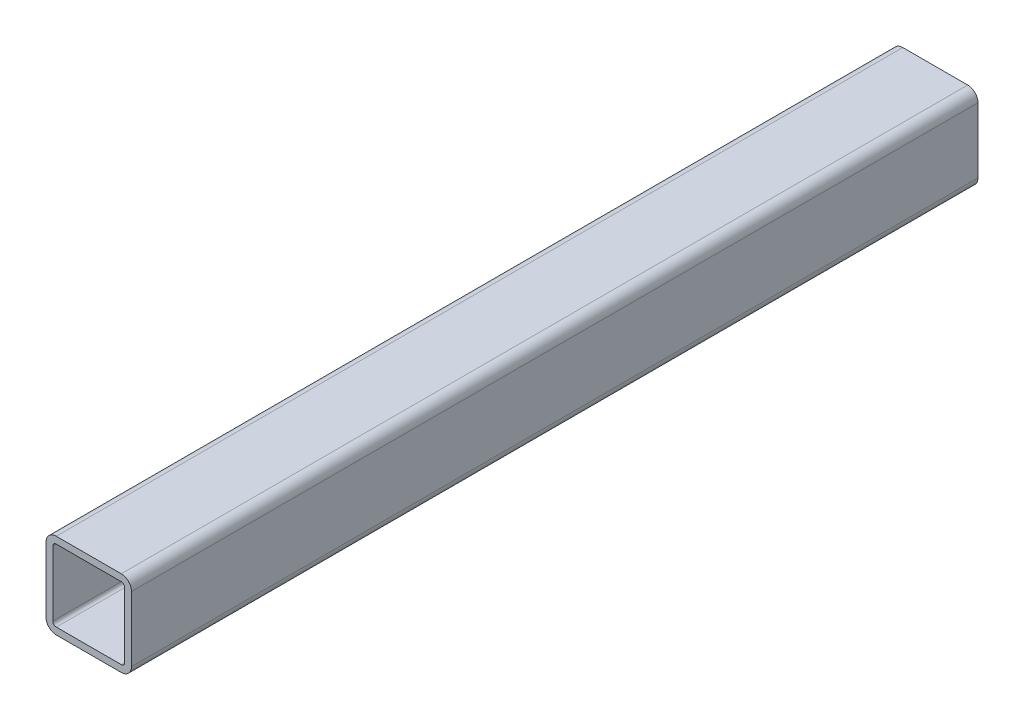
ISO-10303-21;
HEADER;
FILE_DESCRIPTION(('STEP AP214'),'2;1');
FILE_NAME('part.step','',(''),(''),'','','');
FILE_SCHEMA(('AUTOMOTIVE_DESIGN { 1 0 10303 214 1 1 1 1 }'));
ENDSEC;
DATA;
#1=APPLICATION_CONTEXT('core data for automotive mechanical design processes');
#2=APPLICATION_PROTOCOL_DEFINITION('international standard','automotive_design',2000,#1);
#3=PRODUCT_CONTEXT('',#1,'mechanical');
#4=PRODUCT('Part','Part','',(#3));
#5=PRODUCT_RELATED_PRODUCT_CATEGORY('part','',(#4));
#6=PRODUCT_DEFINITION_FORMATION('','',#4);
#7=PRODUCT_DEFINITION_CONTEXT('part definition',#1,'design');
#8=PRODUCT_DEFINITION('design','',#6,#7);
#9=PRODUCT_DEFINITION_SHAPE('','',#8);
#10=(LENGTH_UNIT() NAMED_UNIT(*) SI_UNIT(.MILLI.,.METRE.));
#11=(NAMED_UNIT(*) PLANE_ANGLE_UNIT() SI_UNIT($,.RADIAN.));
#12=(NAMED_UNIT(*) SI_UNIT($,.STERADIAN.) SOLID_ANGLE_UNIT());
#13=UNCERTAINTY_MEASURE_WITH_UNIT(LENGTH_MEASURE(1.E-05),#10,'distance_accuracy_value','');
#14=(GEOMETRIC_REPRESENTATION_CONTEXT(3) GLOBAL_UNCERTAINTY_ASSIGNED_CONTEXT((#13)) GLOBAL_UNIT_ASSIGNED_CONTEXT((#10,
#11,#12)) REPRESENTATION_CONTEXT('',''));
#15=CARTESIAN_POINT('',(0.,0.,0.));
#16=DIRECTION('',(0.,0.,1.));
#17=DIRECTION('',(1.,0.,0.));
#18=AXIS2_PLACEMENT_3D('',#15,#16,#17);
#19=CARTESIAN_POINT('',(0.,0.,247.5));
#20=DIRECTION('',(0.,0.,1.));
#21=DIRECTION('',(1.,0.,0.));
#22=AXIS2_PLACEMENT_3D('',#19,#20,#21);
#23=PLANE('',#22);
#24=DIRECTION('',(0.,1.,0.));
#25=VECTOR('',#24,1.);
#26=CARTESIAN_POINT('',(-12.5,-4.75,247.5));
#27=LINE('',#26,#25);
#28=CARTESIAN_POINT('',(-12.5,-9.5,247.5));
#29=VERTEX_POINT('',#28);
#30=CARTESIAN_POINT('',(-12.5,9.5,247.5));
#31=VERTEX_POINT('',#30);
#32=EDGE_CURVE('E210',#29,#31,#27,.T.);
#33=ORIENTED_EDGE('',*,*,#32,.F.);
#34=CARTESIAN_POINT('',(-9.5,-9.5,247.5));
#35=DIRECTION('',(0.,0.,-1.));
#36=DIRECTION('',(1.,0.,0.));
#37=AXIS2_PLACEMENT_3D('',#34,#35,#36);
#38=CIRCLE('',#37,3.);
#39=CARTESIAN_POINT('',(-9.5,-12.5,247.5));
#40=VERTEX_POINT('',#39);
#41=EDGE_CURVE('E237',#40,#29,#38,.T.);
#42=ORIENTED_EDGE('',*,*,#41,.F.);
#43=DIRECTION('',(-1.,0.,0.));
#44=VECTOR('',#43,1.);
#45=CARTESIAN_POINT('',(4.75,-12.5,247.5));
#46=LINE('',#45,#44);
#47=CARTESIAN_POINT('',(9.5,-12.5,247.5));
#48=VERTEX_POINT('',#47);
#49=EDGE_CURVE('E273',#48,#40,#46,.T.);
#50=ORIENTED_EDGE('',*,*,#49,.F.);
#51=CARTESIAN_POINT('',(9.5,-9.5,247.5));
#52=DIRECTION('',(0.,0.,-1.));
#53=DIRECTION('',(0.,1.,0.));
#54=AXIS2_PLACEMENT_3D('',#51,#52,#53);
#55=CIRCLE('',#54,3.);
#56=CARTESIAN_POINT('',(12.5,-9.5,247.5));
#57=VERTEX_POINT('',#56);
#58=EDGE_CURVE('E244',#57,#48,#55,.T.);
#59=ORIENTED_EDGE('',*,*,#58,.F.);
#60=DIRECTION('',(0.,-1.,0.));
#61=VECTOR('',#60,1.);
#62=CARTESIAN_POINT('',(12.5,4.75,247.5));
#63=LINE('',#62,#61);
#64=CARTESIAN_POINT('',(12.5,9.5,247.5));
#65=VERTEX_POINT('',#64);
#66=EDGE_CURVE('E300',#65,#57,#63,.T.);
#67=ORIENTED_EDGE('',*,*,#66,.F.);
#68=CARTESIAN_POINT('',(9.5,9.5,247.5));
#69=DIRECTION('',(0.,0.,-1.));
#70=DIRECTION('',(-1.,0.,0.));
#71=AXIS2_PLACEMENT_3D('',#68,#69,#70);
#72=CIRCLE('',#71,3.);
#73=CARTESIAN_POINT('',(9.5,12.5,247.5));
#74=VERTEX_POINT('',#73);
#75=EDGE_CURVE('E27',#74,#65,#72,.T.);
#76=ORIENTED_EDGE('',*,*,#75,.F.);
#77=DIRECTION('',(1.,0.,0.));
#78=VECTOR('',#77,1.);
#79=CARTESIAN_POINT('',(-4.75,12.5,247.5));
#80=LINE('',#79,#78);
#81=CARTESIAN_POINT('',(-9.5,12.5,247.5));
#82=VERTEX_POINT('',#81);
#83=EDGE_CURVE('E204',#82,#74,#80,.T.);
#84=ORIENTED_EDGE('',*,*,#83,.F.);
#85=CARTESIAN_POINT('',(-9.5,9.5,247.5));
#86=DIRECTION('',(0.,0.,-1.));
#87=DIRECTION('',(0.,-1.,0.));
#88=AXIS2_PLACEMENT_3D('',#85,#86,#87);
#89=CIRCLE('',#88,3.);
#90=EDGE_CURVE('E220',#31,#82,#89,.T.);
#91=ORIENTED_EDGE('',*,*,#90,.F.);
#92=EDGE_LOOP('',(#33,#42,#50,#59,#67,#76,#84,#91));
#93=FACE_BOUND('',#92,.T.);
#94=DIRECTION('',(-1.,0.,0.));
#95=VECTOR('',#94,1.);
#96=CARTESIAN_POINT('',(-4.75,10.5,247.5));
#97=LINE('',#96,#95);
#98=CARTESIAN_POINT('',(9.5,10.5,247.5));
#99=VERTEX_POINT('',#98);
#100=CARTESIAN_POINT('',(-9.5,10.5,247.5));
#101=VERTEX_POINT('',#100);
#102=EDGE_CURVE('E257',#99,#101,#97,.T.);
#103=ORIENTED_EDGE('',*,*,#102,.F.);
#104=CARTESIAN_POINT('',(9.5,9.5,247.5));
#105=DIRECTION('',(0.,0.,1.));
#106=DIRECTION('',(-1.,0.,0.));
#107=AXIS2_PLACEMENT_3D('',#104,#105,#106);
#108=CIRCLE('',#107,1.);
#109=CARTESIAN_POINT('',(10.5,9.5,247.5));
#110=VERTEX_POINT('',#109);
#111=EDGE_CURVE('E173',#110,#99,#108,.T.);
#112=ORIENTED_EDGE('',*,*,#111,.F.);
#113=DIRECTION('',(0.,1.,0.));
#114=VECTOR('',#113,1.);
#115=CARTESIAN_POINT('',(10.5,4.75,247.5));
#116=LINE('',#115,#114);
#117=CARTESIAN_POINT('',(10.5,-9.5,247.5));
#118=VERTEX_POINT('',#117);
#119=EDGE_CURVE('E167',#118,#110,#116,.T.);
#120=ORIENTED_EDGE('',*,*,#119,.F.);
#121=CARTESIAN_POINT('',(9.5,-9.5,247.5));
#122=DIRECTION('',(0.,0.,1.));
#123=DIRECTION('',(0.,1.,0.));
#124=AXIS2_PLACEMENT_3D('',#121,#122,#123);
#125=CIRCLE('',#124,1.);
#126=CARTESIAN_POINT('',(9.5,-10.5,247.5));
#127=VERTEX_POINT('',#126);
#128=EDGE_CURVE('E170',#127,#118,#125,.T.);
#129=ORIENTED_EDGE('',*,*,#128,.F.);
#130=DIRECTION('',(1.,0.,0.));
#131=VECTOR('',#130,1.);
#132=CARTESIAN_POINT('',(4.75,-10.5,247.5));
#133=LINE('',#132,#131);
#134=CARTESIAN_POINT('',(-9.5,-10.5,247.5));
#135=VERTEX_POINT('',#134);
#136=EDGE_CURVE('E223',#135,#127,#133,.T.);
#137=ORIENTED_EDGE('',*,*,#136,.F.);
#138=CARTESIAN_POINT('',(-9.5,-9.5,247.5));
#139=DIRECTION('',(0.,0.,1.));
#140=DIRECTION('',(1.,0.,0.));
#141=AXIS2_PLACEMENT_3D('',#138,#139,#140);
#142=CIRCLE('',#141,1.);
#143=CARTESIAN_POINT('',(-10.5,-9.5,247.5));
#144=VERTEX_POINT('',#143);
#145=EDGE_CURVE('E228',#144,#135,#142,.T.);
#146=ORIENTED_EDGE('',*,*,#145,.F.);
#147=DIRECTION('',(0.,-1.,0.));
#148=VECTOR('',#147,1.);
#149=CARTESIAN_POINT('',(-10.5,-4.75,247.5));
#150=LINE('',#149,#148);
#151=CARTESIAN_POINT('',(-10.5,9.5,247.5));
#152=VERTEX_POINT('',#151);
#153=EDGE_CURVE('E316',#152,#144,#150,.T.);
#154=ORIENTED_EDGE('',*,*,#153,.F.);
#155=CARTESIAN_POINT('',(-9.5,9.5,247.5));
#156=DIRECTION('',(0.,0.,1.));
#157=DIRECTION('',(0.,-1.,0.));
#158=AXIS2_PLACEMENT_3D('',#155,#156,#157);
#159=CIRCLE('',#158,1.);
#160=EDGE_CURVE('E232',#101,#152,#159,.T.);
#161=ORIENTED_EDGE('',*,*,#160,.F.);
#162=EDGE_LOOP('',(#103,#112,#120,#129,#137,#146,#154,#161));
#163=FACE_BOUND('',#162,.T.);
#164=ADVANCED_FACE('F16',(#93,#163),#23,.T.);
#165=CARTESIAN_POINT('',(0.,0.,0.));
#166=DIRECTION('',(0.,0.,1.));
#167=DIRECTION('',(1.,0.,0.));
#168=AXIS2_PLACEMENT_3D('',#165,#166,#167);
#169=PLANE('',#168);
#170=DIRECTION('',(0.,1.,0.));
#171=VECTOR('',#170,1.);
#172=CARTESIAN_POINT('',(-12.5,-4.75,0.));
#173=LINE('',#172,#171);
#174=CARTESIAN_POINT('',(-12.5,-9.5,0.));
#175=VERTEX_POINT('',#174);
#176=CARTESIAN_POINT('',(-12.5,9.5,0.));
#177=VERTEX_POINT('',#176);
#178=EDGE_CURVE('E216',#175,#177,#173,.T.);
#179=ORIENTED_EDGE('',*,*,#178,.T.);
#180=CARTESIAN_POINT('',(-9.5,9.5,0.));
#181=DIRECTION('',(0.,0.,-1.));
#182=DIRECTION('',(0.,-1.,0.));
#183=AXIS2_PLACEMENT_3D('',#180,#181,#182);
#184=CIRCLE('',#183,3.);
#185=CARTESIAN_POINT('',(-9.5,12.5,0.));
#186=VERTEX_POINT('',#185);
#187=EDGE_CURVE('E243',#177,#186,#184,.T.);
#188=ORIENTED_EDGE('',*,*,#187,.T.);
#189=DIRECTION('',(1.,0.,0.));
#190=VECTOR('',#189,1.);
#191=CARTESIAN_POINT('',(-4.75,12.5,0.));
#192=LINE('',#191,#190);
#193=CARTESIAN_POINT('',(9.5,12.5,0.));
#194=VERTEX_POINT('',#193);
#195=EDGE_CURVE('E203',#186,#194,#192,.T.);
#196=ORIENTED_EDGE('',*,*,#195,.T.);
#197=CARTESIAN_POINT('',(9.5,9.5,0.));
#198=DIRECTION('',(0.,0.,-1.));
#199=DIRECTION('',(-1.,0.,0.));
#200=AXIS2_PLACEMENT_3D('',#197,#198,#199);
#201=CIRCLE('',#200,3.);
#202=CARTESIAN_POINT('',(12.5,9.5,0.));
#203=VERTEX_POINT('',#202);
#204=EDGE_CURVE('E11',#194,#203,#201,.T.);
#205=ORIENTED_EDGE('',*,*,#204,.T.);
#206=DIRECTION('',(0.,-1.,0.));
#207=VECTOR('',#206,1.);
#208=CARTESIAN_POINT('',(12.5,4.75,0.));
#209=LINE('',#208,#207);
#210=CARTESIAN_POINT('',(12.5,-9.5,0.));
#211=VERTEX_POINT('',#210);
#212=EDGE_CURVE('E205',#203,#211,#209,.T.);
#213=ORIENTED_EDGE('',*,*,#212,.T.);
#214=CARTESIAN_POINT('',(9.5,-9.5,0.));
#215=DIRECTION('',(0.,0.,-1.));
#216=DIRECTION('',(0.,1.,0.));
#217=AXIS2_PLACEMENT_3D('',#214,#215,#216);
#218=CIRCLE('',#217,3.);
#219=CARTESIAN_POINT('',(9.5,-12.5,0.));
#220=VERTEX_POINT('',#219);
#221=EDGE_CURVE('E252',#211,#220,#218,.T.);
#222=ORIENTED_EDGE('',*,*,#221,.T.);
#223=DIRECTION('',(-1.,0.,0.));
#224=VECTOR('',#223,1.);
#225=CARTESIAN_POINT('',(4.75,-12.5,0.));
#226=LINE('',#225,#224);
#227=CARTESIAN_POINT('',(-9.5,-12.5,0.));
#228=VERTEX_POINT('',#227);
#229=EDGE_CURVE('E233',#220,#228,#226,.T.);
#230=ORIENTED_EDGE('',*,*,#229,.T.);
#231=CARTESIAN_POINT('',(-9.5,-9.5,0.));
#232=DIRECTION('',(0.,0.,-1.));
#233=DIRECTION('',(1.,0.,0.));
#234=AXIS2_PLACEMENT_3D('',#231,#232,#233);
#235=CIRCLE('',#234,3.);
#236=EDGE_CURVE('E253',#228,#175,#235,.T.);
#237=ORIENTED_EDGE('',*,*,#236,.T.);
#238=EDGE_LOOP('',(#179,#188,#196,#205,#213,#222,#230,#237));
#239=FACE_BOUND('',#238,.T.);
#240=DIRECTION('',(-1.,0.,0.));
#241=VECTOR('',#240,1.);
#242=CARTESIAN_POINT('',(-4.75,10.5,0.));
#243=LINE('',#242,#241);
#244=CARTESIAN_POINT('',(9.5,10.5,0.));
#245=VERTEX_POINT('',#244);
#246=CARTESIAN_POINT('',(-9.5,10.5,0.));
#247=VERTEX_POINT('',#246);
#248=EDGE_CURVE('E224',#245,#247,#243,.T.);
#249=ORIENTED_EDGE('',*,*,#248,.T.);
#250=CARTESIAN_POINT('',(-9.5,9.5,0.));
#251=DIRECTION('',(0.,0.,1.));
#252=DIRECTION('',(0.,-1.,0.));
#253=AXIS2_PLACEMENT_3D('',#250,#251,#252);
#254=CIRCLE('',#253,1.);
#255=CARTESIAN_POINT('',(-10.5,9.5,0.));
#256=VERTEX_POINT('',#255);
#257=EDGE_CURVE('E215',#247,#256,#254,.T.);
#258=ORIENTED_EDGE('',*,*,#257,.T.);
#259=DIRECTION('',(0.,-1.,0.));
#260=VECTOR('',#259,1.);
#261=CARTESIAN_POINT('',(-10.5,-4.75,0.));
#262=LINE('',#261,#260);
#263=CARTESIAN_POINT('',(-10.5,-9.5,0.));
#264=VERTEX_POINT('',#263);
#265=EDGE_CURVE('E319',#256,#264,#262,.T.);
#266=ORIENTED_EDGE('',*,*,#265,.T.);
#267=CARTESIAN_POINT('',(-9.5,-9.5,0.));
#268=DIRECTION('',(0.,0.,1.));
#269=DIRECTION('',(1.,0.,0.));
#270=AXIS2_PLACEMENT_3D('',#267,#268,#269);
#271=CIRCLE('',#270,1.);
#272=CARTESIAN_POINT('',(-9.5,-10.5,0.));
#273=VERTEX_POINT('',#272);
#274=EDGE_CURVE('E288',#264,#273,#271,.T.);
#275=ORIENTED_EDGE('',*,*,#274,.T.);
#276=DIRECTION('',(1.,0.,0.));
#277=VECTOR('',#276,1.);
#278=CARTESIAN_POINT('',(4.75,-10.5,0.));
#279=LINE('',#278,#277);
#280=CARTESIAN_POINT('',(9.5,-10.5,0.));
#281=VERTEX_POINT('',#280);
#282=EDGE_CURVE('E196',#273,#281,#279,.T.);
#283=ORIENTED_EDGE('',*,*,#282,.T.);
#284=CARTESIAN_POINT('',(9.5,-9.5,0.));
#285=DIRECTION('',(0.,0.,1.));
#286=DIRECTION('',(0.,1.,0.));
#287=AXIS2_PLACEMENT_3D('',#284,#285,#286);
#288=CIRCLE('',#287,1.);
#289=CARTESIAN_POINT('',(10.5,-9.5,0.));
#290=VERTEX_POINT('',#289);
#291=EDGE_CURVE('E177',#281,#290,#288,.T.);
#292=ORIENTED_EDGE('',*,*,#291,.T.);
#293=DIRECTION('',(0.,1.,0.));
#294=VECTOR('',#293,1.);
#295=CARTESIAN_POINT('',(10.5,4.75,0.));
#296=LINE('',#295,#294);
#297=CARTESIAN_POINT('',(10.5,9.5,0.));
#298=VERTEX_POINT('',#297);
#299=EDGE_CURVE('E159',#290,#298,#296,.T.);
#300=ORIENTED_EDGE('',*,*,#299,.T.);
#301=CARTESIAN_POINT('',(9.5,9.5,0.));
#302=DIRECTION('',(0.,0.,1.));
#303=DIRECTION('',(-1.,0.,0.));
#304=AXIS2_PLACEMENT_3D('',#301,#302,#303);
#305=CIRCLE('',#304,1.);
#306=EDGE_CURVE('E269',#298,#245,#305,.T.);
#307=ORIENTED_EDGE('',*,*,#306,.T.);
#308=EDGE_LOOP('',(#249,#258,#266,#275,#283,#292,#300,#307));
#309=FACE_BOUND('',#308,.T.);
#310=ADVANCED_FACE('F348',(#239,#309),#169,.F.);
#311=CARTESIAN_POINT('',(9.5,9.5,0.));
#312=DIRECTION('',(0.,0.,1.));
#313=DIRECTION('',(-1.,0.,0.));
#314=AXIS2_PLACEMENT_3D('',#311,#312,#313);
#315=CYLINDRICAL_SURFACE('',#314,3.);
#316=ORIENTED_EDGE('',*,*,#75,.T.);
#317=DIRECTION('',(0.,0.,1.));
#318=VECTOR('',#317,1.);
#319=CARTESIAN_POINT('',(12.5,9.5,0.));
#320=LINE('',#319,#318);
#321=EDGE_CURVE('E209',#203,#65,#320,.T.);
#322=ORIENTED_EDGE('',*,*,#321,.F.);
#323=ORIENTED_EDGE('',*,*,#204,.F.);
#324=DIRECTION('',(0.,0.,1.));
#325=VECTOR('',#324,1.);
#326=CARTESIAN_POINT('',(9.5,12.5,0.));
#327=LINE('',#326,#325);
#328=EDGE_CURVE('E200',#194,#74,#327,.T.);
#329=ORIENTED_EDGE('',*,*,#328,.T.);
#330=EDGE_LOOP('',(#316,#322,#323,#329));
#331=FACE_BOUND('',#330,.T.);
#332=ADVANCED_FACE('F639',(#331),#315,.T.);
#333=CARTESIAN_POINT('',(-9.5,12.5,0.));
#334=DIRECTION('',(0.,1.,0.));
#335=DIRECTION('',(1.,0.,0.));
#336=AXIS2_PLACEMENT_3D('',#333,#334,#335);
#337=PLANE('',#336);
#338=ORIENTED_EDGE('',*,*,#83,.T.);
#339=ORIENTED_EDGE('',*,*,#328,.F.);
#340=ORIENTED_EDGE('',*,*,#195,.F.);
#341=DIRECTION('',(0.,0.,1.));
#342=VECTOR('',#341,1.);
#343=CARTESIAN_POINT('',(-9.5,12.5,0.));
#344=LINE('',#343,#342);
#345=EDGE_CURVE('E239',#186,#82,#344,.T.);
#346=ORIENTED_EDGE('',*,*,#345,.T.);
#347=EDGE_LOOP('',(#338,#339,#340,#346));
#348=FACE_BOUND('',#347,.T.);
#349=ADVANCED_FACE('F629',(#348),#337,.T.);
#350=CARTESIAN_POINT('',(-9.5,9.5,0.));
#351=DIRECTION('',(0.,0.,1.));
#352=DIRECTION('',(0.,-1.,0.));
#353=AXIS2_PLACEMENT_3D('',#350,#351,#352);
#354=CYLINDRICAL_SURFACE('',#353,3.);
#355=ORIENTED_EDGE('',*,*,#90,.T.);
#356=ORIENTED_EDGE('',*,*,#345,.F.);
#357=ORIENTED_EDGE('',*,*,#187,.F.);
#358=DIRECTION('',(0.,0.,1.));
#359=VECTOR('',#358,1.);
#360=CARTESIAN_POINT('',(-12.5,9.5,0.));
#361=LINE('',#360,#359);
#362=EDGE_CURVE('E214',#177,#31,#361,.T.);
#363=ORIENTED_EDGE('',*,*,#362,.T.);
#364=EDGE_LOOP('',(#355,#356,#357,#363));
#365=FACE_BOUND('',#364,.T.);
#366=ADVANCED_FACE('F618',(#365),#354,.T.);
#367=CARTESIAN_POINT('',(-12.5,-9.5,0.));
#368=DIRECTION('',(-1.,0.,0.));
#369=DIRECTION('',(0.,1.,0.));
#370=AXIS2_PLACEMENT_3D('',#367,#368,#369);
#371=PLANE('',#370);
#372=ORIENTED_EDGE('',*,*,#32,.T.);
#373=ORIENTED_EDGE('',*,*,#362,.F.);
#374=ORIENTED_EDGE('',*,*,#178,.F.);
#375=DIRECTION('',(0.,0.,1.));
#376=VECTOR('',#375,1.);
#377=CARTESIAN_POINT('',(-12.5,-9.5,0.));
#378=LINE('',#377,#376);
#379=EDGE_CURVE('E258',#175,#29,#378,.T.);
#380=ORIENTED_EDGE('',*,*,#379,.T.);
#381=EDGE_LOOP('',(#372,#373,#374,#380));
#382=FACE_BOUND('',#381,.T.);
#383=ADVANCED_FACE('F608',(#382),#371,.T.);
#384=CARTESIAN_POINT('',(-9.5,9.5,0.));
#385=DIRECTION('',(0.,0.,1.));
#386=DIRECTION('',(0.,-1.,0.));
#387=AXIS2_PLACEMENT_3D('',#384,#385,#386);
#388=CYLINDRICAL_SURFACE('',#387,1.);
#389=ORIENTED_EDGE('',*,*,#160,.T.);
#390=DIRECTION('',(0.,0.,1.));
#391=VECTOR('',#390,1.);
#392=CARTESIAN_POINT('',(-10.5,9.5,0.));
#393=LINE('',#392,#391);
#394=EDGE_CURVE('E287',#256,#152,#393,.T.);
#395=ORIENTED_EDGE('',*,*,#394,.F.);
#396=ORIENTED_EDGE('',*,*,#257,.F.);
#397=DIRECTION('',(0.,0.,1.));
#398=VECTOR('',#397,1.);
#399=CARTESIAN_POINT('',(-9.5,10.5,0.));
#400=LINE('',#399,#398);
#401=EDGE_CURVE('E229',#247,#101,#400,.T.);
#402=ORIENTED_EDGE('',*,*,#401,.T.);
#403=EDGE_LOOP('',(#389,#395,#396,#402));
#404=FACE_BOUND('',#403,.T.);
#405=ADVANCED_FACE('F599',(#404),#388,.F.);
#406=CARTESIAN_POINT('',(-10.5,-9.5,0.));
#407=DIRECTION('',(-1.,0.,0.));
#408=DIRECTION('',(0.,0.,1.));
#409=AXIS2_PLACEMENT_3D('',#406,#407,#408);
#410=PLANE('',#409);
#411=ORIENTED_EDGE('',*,*,#153,.T.);
#412=DIRECTION('',(0.,0.,1.));
#413=VECTOR('',#412,1.);
#414=CARTESIAN_POINT('',(-10.5,-9.5,0.));
#415=LINE('',#414,#413);
#416=EDGE_CURVE('E291',#264,#144,#415,.T.);
#417=ORIENTED_EDGE('',*,*,#416,.F.);
#418=ORIENTED_EDGE('',*,*,#265,.F.);
#419=ORIENTED_EDGE('',*,*,#394,.T.);
#420=EDGE_LOOP('',(#411,#417,#418,#419));
#421=FACE_BOUND('',#420,.T.);
#422=ADVANCED_FACE('F353',(#421),#410,.F.);
#423=CARTESIAN_POINT('',(-9.5,-9.5,0.));
#424=DIRECTION('',(0.,0.,1.));
#425=DIRECTION('',(1.,0.,0.));
#426=AXIS2_PLACEMENT_3D('',#423,#424,#425);
#427=CYLINDRICAL_SURFACE('',#426,1.);
#428=ORIENTED_EDGE('',*,*,#145,.T.);
#429=DIRECTION('',(0.,0.,1.));
#430=VECTOR('',#429,1.);
#431=CARTESIAN_POINT('',(-9.5,-10.5,0.));
#432=LINE('',#431,#430);
#433=EDGE_CURVE('E189',#273,#135,#432,.T.);
#434=ORIENTED_EDGE('',*,*,#433,.F.);
#435=ORIENTED_EDGE('',*,*,#274,.F.);
#436=ORIENTED_EDGE('',*,*,#416,.T.);
#437=EDGE_LOOP('',(#428,#434,#435,#436));
#438=FACE_BOUND('',#437,.T.);
#439=ADVANCED_FACE('F357',(#438),#427,.F.);
#440=CARTESIAN_POINT('',(-9.5,10.5,0.));
#441=DIRECTION('',(0.,1.,0.));
#442=DIRECTION('',(1.,0.,0.));
#443=AXIS2_PLACEMENT_3D('',#440,#441,#442);
#444=PLANE('',#443);
#445=ORIENTED_EDGE('',*,*,#102,.T.);
#446=ORIENTED_EDGE('',*,*,#401,.F.);
#447=ORIENTED_EDGE('',*,*,#248,.F.);
#448=DIRECTION('',(0.,0.,1.));
#449=VECTOR('',#448,1.);
#450=CARTESIAN_POINT('',(9.5,10.5,0.));
#451=LINE('',#450,#449);
#452=EDGE_CURVE('E265',#245,#99,#451,.T.);
#453=ORIENTED_EDGE('',*,*,#452,.T.);
#454=EDGE_LOOP('',(#445,#446,#447,#453));
#455=FACE_BOUND('',#454,.T.);
#456=ADVANCED_FACE('F572',(#455),#444,.F.);
#457=CARTESIAN_POINT('',(-9.5,-9.5,0.));
#458=DIRECTION('',(0.,0.,1.));
#459=DIRECTION('',(1.,0.,0.));
#460=AXIS2_PLACEMENT_3D('',#457,#458,#459);
#461=CYLINDRICAL_SURFACE('',#460,3.);
#462=ORIENTED_EDGE('',*,*,#41,.T.);
#463=ORIENTED_EDGE('',*,*,#379,.F.);
#464=ORIENTED_EDGE('',*,*,#236,.F.);
#465=DIRECTION('',(0.,0.,1.));
#466=VECTOR('',#465,1.);
#467=CARTESIAN_POINT('',(-9.5,-12.5,0.));
#468=LINE('',#467,#466);
#469=EDGE_CURVE('E238',#228,#40,#468,.T.);
#470=ORIENTED_EDGE('',*,*,#469,.T.);
#471=EDGE_LOOP('',(#462,#463,#464,#470));
#472=FACE_BOUND('',#471,.T.);
#473=ADVANCED_FACE('F18',(#472),#461,.T.);
#474=CARTESIAN_POINT('',(9.5,-12.5,0.));
#475=DIRECTION('',(0.,-1.,0.));
#476=DIRECTION('',(0.,0.,-1.));
#477=AXIS2_PLACEMENT_3D('',#474,#475,#476);
#478=PLANE('',#477);
#479=ORIENTED_EDGE('',*,*,#49,.T.);
#480=ORIENTED_EDGE('',*,*,#469,.F.);
#481=ORIENTED_EDGE('',*,*,#229,.F.);
#482=DIRECTION('',(0.,0.,1.));
#483=VECTOR('',#482,1.);
#484=CARTESIAN_POINT('',(9.5,-12.5,0.));
#485=LINE('',#484,#483);
#486=EDGE_CURVE('E248',#220,#48,#485,.T.);
#487=ORIENTED_EDGE('',*,*,#486,.T.);
#488=EDGE_LOOP('',(#479,#480,#481,#487));
#489=FACE_BOUND('',#488,.T.);
#490=ADVANCED_FACE('F549',(#489),#478,.T.);
#491=CARTESIAN_POINT('',(9.5,-9.5,0.));
#492=DIRECTION('',(0.,0.,1.));
#493=DIRECTION('',(0.,1.,0.));
#494=AXIS2_PLACEMENT_3D('',#491,#492,#493);
#495=CYLINDRICAL_SURFACE('',#494,3.);
#496=ORIENTED_EDGE('',*,*,#58,.T.);
#497=ORIENTED_EDGE('',*,*,#486,.F.);
#498=ORIENTED_EDGE('',*,*,#221,.F.);
#499=DIRECTION('',(0.,0.,1.));
#500=VECTOR('',#499,1.);
#501=CARTESIAN_POINT('',(12.5,-9.5,0.));
#502=LINE('',#501,#500);
#503=EDGE_CURVE('E20',#211,#57,#502,.T.);
#504=ORIENTED_EDGE('',*,*,#503,.T.);
#505=EDGE_LOOP('',(#496,#497,#498,#504));
#506=FACE_BOUND('',#505,.T.);
#507=ADVANCED_FACE('F539',(#506),#495,.T.);
#508=CARTESIAN_POINT('',(12.5,9.5,0.));
#509=DIRECTION('',(1.,0.,0.));
#510=DIRECTION('',(0.,1.,0.));
#511=AXIS2_PLACEMENT_3D('',#508,#509,#510);
#512=PLANE('',#511);
#513=ORIENTED_EDGE('',*,*,#66,.T.);
#514=ORIENTED_EDGE('',*,*,#503,.F.);
#515=ORIENTED_EDGE('',*,*,#212,.F.);
#516=ORIENTED_EDGE('',*,*,#321,.T.);
#517=EDGE_LOOP('',(#513,#514,#515,#516));
#518=FACE_BOUND('',#517,.T.);
#519=ADVANCED_FACE('F529',(#518),#512,.T.);
#520=CARTESIAN_POINT('',(9.5,9.5,0.));
#521=DIRECTION('',(0.,0.,1.));
#522=DIRECTION('',(-1.,0.,0.));
#523=AXIS2_PLACEMENT_3D('',#520,#521,#522);
#524=CYLINDRICAL_SURFACE('',#523,1.);
#525=ORIENTED_EDGE('',*,*,#111,.T.);
#526=ORIENTED_EDGE('',*,*,#452,.F.);
#527=ORIENTED_EDGE('',*,*,#306,.F.);
#528=DIRECTION('',(0.,0.,1.));
#529=VECTOR('',#528,1.);
#530=CARTESIAN_POINT('',(10.5,9.5,0.));
#531=LINE('',#530,#529);
#532=EDGE_CURVE('E176',#298,#110,#531,.T.);
#533=ORIENTED_EDGE('',*,*,#532,.T.);
#534=EDGE_LOOP('',(#525,#526,#527,#533));
#535=FACE_BOUND('',#534,.T.);
#536=ADVANCED_FACE('F517',(#535),#524,.F.);
#537=CARTESIAN_POINT('',(10.5,9.5,0.));
#538=DIRECTION('',(1.,0.,0.));
#539=DIRECTION('',(0.,-1.,0.));
#540=AXIS2_PLACEMENT_3D('',#537,#538,#539);
#541=PLANE('',#540);
#542=ORIENTED_EDGE('',*,*,#119,.T.);
#543=ORIENTED_EDGE('',*,*,#532,.F.);
#544=ORIENTED_EDGE('',*,*,#299,.F.);
#545=DIRECTION('',(0.,0.,1.));
#546=VECTOR('',#545,1.);
#547=CARTESIAN_POINT('',(10.5,-9.5,0.));
#548=LINE('',#547,#546);
#549=EDGE_CURVE('E179',#290,#118,#548,.T.);
#550=ORIENTED_EDGE('',*,*,#549,.T.);
#551=EDGE_LOOP('',(#542,#543,#544,#550));
#552=FACE_BOUND('',#551,.T.);
#553=ADVANCED_FACE('F180',(#552),#541,.F.);
#554=CARTESIAN_POINT('',(9.5,-9.5,0.));
#555=DIRECTION('',(0.,0.,1.));
#556=DIRECTION('',(0.,1.,0.));
#557=AXIS2_PLACEMENT_3D('',#554,#555,#556);
#558=CYLINDRICAL_SURFACE('',#557,1.);
#559=ORIENTED_EDGE('',*,*,#128,.T.);
#560=ORIENTED_EDGE('',*,*,#549,.F.);
#561=ORIENTED_EDGE('',*,*,#291,.F.);
#562=DIRECTION('',(0.,0.,1.));
#563=VECTOR('',#562,1.);
#564=CARTESIAN_POINT('',(9.5,-10.5,0.));
#565=LINE('',#564,#563);
#566=EDGE_CURVE('E186',#281,#127,#565,.T.);
#567=ORIENTED_EDGE('',*,*,#566,.T.);
#568=EDGE_LOOP('',(#559,#560,#561,#567));
#569=FACE_BOUND('',#568,.T.);
#570=ADVANCED_FACE('F184',(#569),#558,.F.);
#571=CARTESIAN_POINT('',(9.5,-10.5,0.));
#572=DIRECTION('',(0.,-1.,0.));
#573=DIRECTION('',(0.,0.,-1.));
#574=AXIS2_PLACEMENT_3D('',#571,#572,#573);
#575=PLANE('',#574);
#576=ORIENTED_EDGE('',*,*,#136,.T.);
#577=ORIENTED_EDGE('',*,*,#566,.F.);
#578=ORIENTED_EDGE('',*,*,#282,.F.);
#579=ORIENTED_EDGE('',*,*,#433,.T.);
#580=EDGE_LOOP('',(#576,#577,#578,#579));
#581=FACE_BOUND('',#580,.T.);
#582=ADVANCED_FACE('F360',(#581),#575,.F.);
#583=CLOSED_SHELL('',(#164,#310,#332,#349,#366,#383,#405,#422,#439,#456,#473,#490,#507,#519,
#536,#553,#570,#582));
#584=MANIFOLD_SOLID_BREP('B1',#583);
#585=ADVANCED_BREP_SHAPE_REPRESENTATION('',(#18,#584),#14);
#586=SHAPE_DEFINITION_REPRESENTATION(#9,#585);
ENDSEC;
END-ISO-10303-21;
